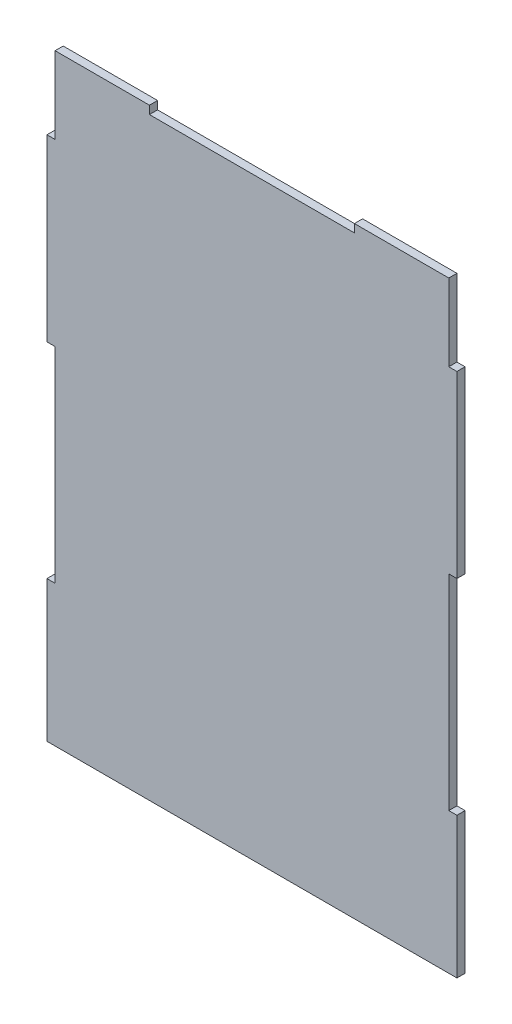
ISO-10303-21;
HEADER;
FILE_DESCRIPTION(('STEP AP214'),'2;1');
FILE_NAME('part.step','',(''),(''),'','','');
FILE_SCHEMA(('AUTOMOTIVE_DESIGN { 1 0 10303 214 1 1 1 1 }'));
ENDSEC;
DATA;
#1=APPLICATION_CONTEXT('core data for automotive mechanical design processes');
#2=APPLICATION_PROTOCOL_DEFINITION('international standard','automotive_design',2000,#1);
#3=PRODUCT_CONTEXT('',#1,'mechanical');
#4=PRODUCT('Part','Part','',(#3));
#5=PRODUCT_RELATED_PRODUCT_CATEGORY('part','',(#4));
#6=PRODUCT_DEFINITION_FORMATION('','',#4);
#7=PRODUCT_DEFINITION_CONTEXT('part definition',#1,'design');
#8=PRODUCT_DEFINITION('design','',#6,#7);
#9=PRODUCT_DEFINITION_SHAPE('','',#8);
#10=(LENGTH_UNIT() NAMED_UNIT(*) SI_UNIT(.MILLI.,.METRE.));
#11=(NAMED_UNIT(*) PLANE_ANGLE_UNIT() SI_UNIT($,.RADIAN.));
#12=(NAMED_UNIT(*) SI_UNIT($,.STERADIAN.) SOLID_ANGLE_UNIT());
#13=UNCERTAINTY_MEASURE_WITH_UNIT(LENGTH_MEASURE(1.E-05),#10,'distance_accuracy_value','');
#14=(GEOMETRIC_REPRESENTATION_CONTEXT(3) GLOBAL_UNCERTAINTY_ASSIGNED_CONTEXT((#13)) GLOBAL_UNIT_ASSIGNED_CONTEXT((#10,
#11,#12)) REPRESENTATION_CONTEXT('',''));
#15=CARTESIAN_POINT('',(0.,0.,0.));
#16=DIRECTION('',(0.,0.,1.));
#17=DIRECTION('',(1.,0.,0.));
#18=AXIS2_PLACEMENT_3D('',#15,#16,#17);
#19=CARTESIAN_POINT('',(-80.,0.,-3.175));
#20=DIRECTION('',(-1.,0.,0.));
#21=DIRECTION('',(0.,0.,1.));
#22=AXIS2_PLACEMENT_3D('',#19,#20,#21);
#23=PLANE('',#22);
#24=DIRECTION('',(0.,-1.,0.));
#25=VECTOR('',#24,1.);
#26=CARTESIAN_POINT('',(-80.,0.,0.));
#27=LINE('',#26,#25);
#28=CARTESIAN_POINT('',(-80.,55.,0.));
#29=VERTEX_POINT('',#28);
#30=CARTESIAN_POINT('',(-80.,0.,0.));
#31=VERTEX_POINT('',#30);
#32=EDGE_CURVE('E251',#29,#31,#27,.T.);
#33=ORIENTED_EDGE('',*,*,#32,.F.);
#34=DIRECTION('',(0.,0.,1.));
#35=VECTOR('',#34,1.);
#36=CARTESIAN_POINT('',(-80.,55.,-3.175));
#37=LINE('',#36,#35);
#38=CARTESIAN_POINT('',(-80.,55.,-3.175));
#39=VERTEX_POINT('',#38);
#40=EDGE_CURVE('E42',#39,#29,#37,.T.);
#41=ORIENTED_EDGE('',*,*,#40,.F.);
#42=DIRECTION('',(0.,-1.,0.));
#43=VECTOR('',#42,1.);
#44=CARTESIAN_POINT('',(-80.,0.,-3.175));
#45=LINE('',#44,#43);
#46=CARTESIAN_POINT('',(-80.,0.,-3.175));
#47=VERTEX_POINT('',#46);
#48=EDGE_CURVE('E189',#39,#47,#45,.T.);
#49=ORIENTED_EDGE('',*,*,#48,.T.);
#50=DIRECTION('',(0.,0.,1.));
#51=VECTOR('',#50,1.);
#52=CARTESIAN_POINT('',(-80.,0.,-3.175));
#53=LINE('',#52,#51);
#54=EDGE_CURVE('E11',#47,#31,#53,.T.);
#55=ORIENTED_EDGE('',*,*,#54,.T.);
#56=EDGE_LOOP('',(#33,#41,#49,#55));
#57=FACE_BOUND('',#56,.T.);
#58=ADVANCED_FACE('F32',(#57),#23,.T.);
#59=CARTESIAN_POINT('',(-80.,55.,-3.175));
#60=DIRECTION('',(0.,1.,0.));
#61=DIRECTION('',(0.,0.,1.));
#62=AXIS2_PLACEMENT_3D('',#59,#60,#61);
#63=PLANE('',#62);
#64=DIRECTION('',(-1.,0.,0.));
#65=VECTOR('',#64,1.);
#66=CARTESIAN_POINT('',(-80.,55.,0.));
#67=LINE('',#66,#65);
#68=CARTESIAN_POINT('',(-76.825,55.,0.));
#69=VERTEX_POINT('',#68);
#70=EDGE_CURVE('E175',#69,#29,#67,.T.);
#71=ORIENTED_EDGE('',*,*,#70,.F.);
#72=DIRECTION('',(0.,0.,1.));
#73=VECTOR('',#72,1.);
#74=CARTESIAN_POINT('',(-76.825,55.,-3.175));
#75=LINE('',#74,#73);
#76=CARTESIAN_POINT('',(-76.825,55.,-3.175));
#77=VERTEX_POINT('',#76);
#78=EDGE_CURVE('E170',#77,#69,#75,.T.);
#79=ORIENTED_EDGE('',*,*,#78,.F.);
#80=DIRECTION('',(-1.,0.,0.));
#81=VECTOR('',#80,1.);
#82=CARTESIAN_POINT('',(-80.,55.,-3.175));
#83=LINE('',#82,#81);
#84=EDGE_CURVE('E173',#77,#39,#83,.T.);
#85=ORIENTED_EDGE('',*,*,#84,.T.);
#86=ORIENTED_EDGE('',*,*,#40,.T.);
#87=EDGE_LOOP('',(#71,#79,#85,#86));
#88=FACE_BOUND('',#87,.T.);
#89=ADVANCED_FACE('F172',(#88),#63,.T.);
#90=CARTESIAN_POINT('',(-76.825,55.,-3.175));
#91=DIRECTION('',(-1.,0.,0.));
#92=DIRECTION('',(0.,0.,1.));
#93=AXIS2_PLACEMENT_3D('',#90,#91,#92);
#94=PLANE('',#93);
#95=DIRECTION('',(0.,-1.,0.));
#96=VECTOR('',#95,1.);
#97=CARTESIAN_POINT('',(-76.825,55.,0.));
#98=LINE('',#97,#96);
#99=CARTESIAN_POINT('',(-76.825,135.,0.));
#100=VERTEX_POINT('',#99);
#101=EDGE_CURVE('E248',#100,#69,#98,.T.);
#102=ORIENTED_EDGE('',*,*,#101,.F.);
#103=DIRECTION('',(0.,0.,1.));
#104=VECTOR('',#103,1.);
#105=CARTESIAN_POINT('',(-76.825,135.,-3.175));
#106=LINE('',#105,#104);
#107=CARTESIAN_POINT('',(-76.825,135.,-3.175));
#108=VERTEX_POINT('',#107);
#109=EDGE_CURVE('E180',#108,#100,#106,.T.);
#110=ORIENTED_EDGE('',*,*,#109,.F.);
#111=DIRECTION('',(0.,-1.,0.));
#112=VECTOR('',#111,1.);
#113=CARTESIAN_POINT('',(-76.825,55.,-3.175));
#114=LINE('',#113,#112);
#115=EDGE_CURVE('E186',#108,#77,#114,.T.);
#116=ORIENTED_EDGE('',*,*,#115,.T.);
#117=ORIENTED_EDGE('',*,*,#78,.T.);
#118=EDGE_LOOP('',(#102,#110,#116,#117));
#119=FACE_BOUND('',#118,.T.);
#120=ADVANCED_FACE('F191',(#119),#94,.T.);
#121=CARTESIAN_POINT('',(-76.825,135.,-3.175));
#122=DIRECTION('',(0.,-1.,0.));
#123=DIRECTION('',(0.,0.,-1.));
#124=AXIS2_PLACEMENT_3D('',#121,#122,#123);
#125=PLANE('',#124);
#126=DIRECTION('',(1.,0.,0.));
#127=VECTOR('',#126,1.);
#128=CARTESIAN_POINT('',(-76.825,135.,0.));
#129=LINE('',#128,#127);
#130=CARTESIAN_POINT('',(-80.,135.,0.));
#131=VERTEX_POINT('',#130);
#132=EDGE_CURVE('E245',#131,#100,#129,.T.);
#133=ORIENTED_EDGE('',*,*,#132,.F.);
#134=DIRECTION('',(0.,0.,1.));
#135=VECTOR('',#134,1.);
#136=CARTESIAN_POINT('',(-80.,135.,-3.175));
#137=LINE('',#136,#135);
#138=CARTESIAN_POINT('',(-80.,135.,-3.175));
#139=VERTEX_POINT('',#138);
#140=EDGE_CURVE('E256',#139,#131,#137,.T.);
#141=ORIENTED_EDGE('',*,*,#140,.F.);
#142=DIRECTION('',(1.,0.,0.));
#143=VECTOR('',#142,1.);
#144=CARTESIAN_POINT('',(-76.825,135.,-3.175));
#145=LINE('',#144,#143);
#146=EDGE_CURVE('E192',#139,#108,#145,.T.);
#147=ORIENTED_EDGE('',*,*,#146,.T.);
#148=ORIENTED_EDGE('',*,*,#109,.T.);
#149=EDGE_LOOP('',(#133,#141,#147,#148));
#150=FACE_BOUND('',#149,.T.);
#151=ADVANCED_FACE('F306',(#150),#125,.T.);
#152=CARTESIAN_POINT('',(-80.,135.,-3.175));
#153=DIRECTION('',(-1.,0.,0.));
#154=DIRECTION('',(0.,0.,1.));
#155=AXIS2_PLACEMENT_3D('',#152,#153,#154);
#156=PLANE('',#155);
#157=DIRECTION('',(0.,-1.,0.));
#158=VECTOR('',#157,1.);
#159=CARTESIAN_POINT('',(-80.,135.,0.));
#160=LINE('',#159,#158);
#161=CARTESIAN_POINT('',(-80.,205.,0.));
#162=VERTEX_POINT('',#161);
#163=EDGE_CURVE('E242',#162,#131,#160,.T.);
#164=ORIENTED_EDGE('',*,*,#163,.F.);
#165=DIRECTION('',(0.,0.,1.));
#166=VECTOR('',#165,1.);
#167=CARTESIAN_POINT('',(-80.,205.,-3.175));
#168=LINE('',#167,#166);
#169=CARTESIAN_POINT('',(-80.,205.,-3.175));
#170=VERTEX_POINT('',#169);
#171=EDGE_CURVE('E258',#170,#162,#168,.T.);
#172=ORIENTED_EDGE('',*,*,#171,.F.);
#173=DIRECTION('',(0.,-1.,0.));
#174=VECTOR('',#173,1.);
#175=CARTESIAN_POINT('',(-80.,135.,-3.175));
#176=LINE('',#175,#174);
#177=EDGE_CURVE('E194',#170,#139,#176,.T.);
#178=ORIENTED_EDGE('',*,*,#177,.T.);
#179=ORIENTED_EDGE('',*,*,#140,.T.);
#180=EDGE_LOOP('',(#164,#172,#178,#179));
#181=FACE_BOUND('',#180,.T.);
#182=ADVANCED_FACE('F309',(#181),#156,.T.);
#183=CARTESIAN_POINT('',(-80.,205.,-3.175));
#184=DIRECTION('',(0.,1.,0.));
#185=DIRECTION('',(0.,0.,1.));
#186=AXIS2_PLACEMENT_3D('',#183,#184,#185);
#187=PLANE('',#186);
#188=DIRECTION('',(-1.,0.,0.));
#189=VECTOR('',#188,1.);
#190=CARTESIAN_POINT('',(-80.,205.,0.));
#191=LINE('',#190,#189);
#192=CARTESIAN_POINT('',(-76.825,205.,0.));
#193=VERTEX_POINT('',#192);
#194=EDGE_CURVE('E239',#193,#162,#191,.T.);
#195=ORIENTED_EDGE('',*,*,#194,.F.);
#196=DIRECTION('',(0.,0.,1.));
#197=VECTOR('',#196,1.);
#198=CARTESIAN_POINT('',(-76.825,205.,-3.175));
#199=LINE('',#198,#197);
#200=CARTESIAN_POINT('',(-76.825,205.,-3.175));
#201=VERTEX_POINT('',#200);
#202=EDGE_CURVE('E260',#201,#193,#199,.T.);
#203=ORIENTED_EDGE('',*,*,#202,.F.);
#204=DIRECTION('',(-1.,0.,0.));
#205=VECTOR('',#204,1.);
#206=CARTESIAN_POINT('',(-80.,205.,-3.175));
#207=LINE('',#206,#205);
#208=EDGE_CURVE('E552',#201,#170,#207,.T.);
#209=ORIENTED_EDGE('',*,*,#208,.T.);
#210=ORIENTED_EDGE('',*,*,#171,.T.);
#211=EDGE_LOOP('',(#195,#203,#209,#210));
#212=FACE_BOUND('',#211,.T.);
#213=ADVANCED_FACE('F313',(#212),#187,.T.);
#214=CARTESIAN_POINT('',(-76.825,205.,-3.175));
#215=DIRECTION('',(-1.,0.,0.));
#216=DIRECTION('',(0.,0.,1.));
#217=AXIS2_PLACEMENT_3D('',#214,#215,#216);
#218=PLANE('',#217);
#219=DIRECTION('',(0.,-1.,0.));
#220=VECTOR('',#219,1.);
#221=CARTESIAN_POINT('',(-76.825,205.,0.));
#222=LINE('',#221,#220);
#223=CARTESIAN_POINT('',(-76.825,235.,0.));
#224=VERTEX_POINT('',#223);
#225=EDGE_CURVE('E236',#224,#193,#222,.T.);
#226=ORIENTED_EDGE('',*,*,#225,.F.);
#227=DIRECTION('',(0.,0.,1.));
#228=VECTOR('',#227,1.);
#229=CARTESIAN_POINT('',(-76.825,235.,-3.175));
#230=LINE('',#229,#228);
#231=CARTESIAN_POINT('',(-76.825,235.,-3.175));
#232=VERTEX_POINT('',#231);
#233=EDGE_CURVE('E262',#232,#224,#230,.T.);
#234=ORIENTED_EDGE('',*,*,#233,.F.);
#235=DIRECTION('',(0.,-1.,0.));
#236=VECTOR('',#235,1.);
#237=CARTESIAN_POINT('',(-76.825,205.,-3.175));
#238=LINE('',#237,#236);
#239=EDGE_CURVE('E549',#232,#201,#238,.T.);
#240=ORIENTED_EDGE('',*,*,#239,.T.);
#241=ORIENTED_EDGE('',*,*,#202,.T.);
#242=EDGE_LOOP('',(#226,#234,#240,#241));
#243=FACE_BOUND('',#242,.T.);
#244=ADVANCED_FACE('F317',(#243),#218,.T.);
#245=CARTESIAN_POINT('',(-76.825,235.,-3.175));
#246=DIRECTION('',(0.,1.,0.));
#247=DIRECTION('',(0.,0.,1.));
#248=AXIS2_PLACEMENT_3D('',#245,#246,#247);
#249=PLANE('',#248);
#250=DIRECTION('',(-1.,0.,0.));
#251=VECTOR('',#250,1.);
#252=CARTESIAN_POINT('',(-76.825,235.,0.));
#253=LINE('',#252,#251);
#254=CARTESIAN_POINT('',(-40.,235.,0.));
#255=VERTEX_POINT('',#254);
#256=EDGE_CURVE('E233',#255,#224,#253,.T.);
#257=ORIENTED_EDGE('',*,*,#256,.F.);
#258=DIRECTION('',(0.,0.,1.));
#259=VECTOR('',#258,1.);
#260=CARTESIAN_POINT('',(-40.,235.,-3.175));
#261=LINE('',#260,#259);
#262=CARTESIAN_POINT('',(-40.,235.,-3.175));
#263=VERTEX_POINT('',#262);
#264=EDGE_CURVE('E264',#263,#255,#261,.T.);
#265=ORIENTED_EDGE('',*,*,#264,.F.);
#266=DIRECTION('',(-1.,0.,0.));
#267=VECTOR('',#266,1.);
#268=CARTESIAN_POINT('',(-76.825,235.,-3.175));
#269=LINE('',#268,#267);
#270=EDGE_CURVE('E541',#263,#232,#269,.T.);
#271=ORIENTED_EDGE('',*,*,#270,.T.);
#272=ORIENTED_EDGE('',*,*,#233,.T.);
#273=EDGE_LOOP('',(#257,#265,#271,#272));
#274=FACE_BOUND('',#273,.T.);
#275=ADVANCED_FACE('F321',(#274),#249,.T.);
#276=CARTESIAN_POINT('',(-40.,235.,-3.175));
#277=DIRECTION('',(1.,0.,0.));
#278=DIRECTION('',(0.,0.,-1.));
#279=AXIS2_PLACEMENT_3D('',#276,#277,#278);
#280=PLANE('',#279);
#281=DIRECTION('',(0.,1.,0.));
#282=VECTOR('',#281,1.);
#283=CARTESIAN_POINT('',(-40.,235.,0.));
#284=LINE('',#283,#282);
#285=CARTESIAN_POINT('',(-40.,231.825,0.));
#286=VERTEX_POINT('',#285);
#287=EDGE_CURVE('E230',#286,#255,#284,.T.);
#288=ORIENTED_EDGE('',*,*,#287,.F.);
#289=DIRECTION('',(0.,0.,1.));
#290=VECTOR('',#289,1.);
#291=CARTESIAN_POINT('',(-40.,231.825,-3.175));
#292=LINE('',#291,#290);
#293=CARTESIAN_POINT('',(-40.,231.825,-3.175));
#294=VERTEX_POINT('',#293);
#295=EDGE_CURVE('E266',#294,#286,#292,.T.);
#296=ORIENTED_EDGE('',*,*,#295,.F.);
#297=DIRECTION('',(0.,1.,0.));
#298=VECTOR('',#297,1.);
#299=CARTESIAN_POINT('',(-40.,235.,-3.175));
#300=LINE('',#299,#298);
#301=EDGE_CURVE('E539',#294,#263,#300,.T.);
#302=ORIENTED_EDGE('',*,*,#301,.T.);
#303=ORIENTED_EDGE('',*,*,#264,.T.);
#304=EDGE_LOOP('',(#288,#296,#302,#303));
#305=FACE_BOUND('',#304,.T.);
#306=ADVANCED_FACE('F325',(#305),#280,.T.);
#307=CARTESIAN_POINT('',(-40.,231.825,-3.175));
#308=DIRECTION('',(0.,1.,0.));
#309=DIRECTION('',(0.,0.,1.));
#310=AXIS2_PLACEMENT_3D('',#307,#308,#309);
#311=PLANE('',#310);
#312=DIRECTION('',(-1.,0.,0.));
#313=VECTOR('',#312,1.);
#314=CARTESIAN_POINT('',(-40.,231.825,0.));
#315=LINE('',#314,#313);
#316=CARTESIAN_POINT('',(40.,231.825,0.));
#317=VERTEX_POINT('',#316);
#318=EDGE_CURVE('E227',#317,#286,#315,.T.);
#319=ORIENTED_EDGE('',*,*,#318,.F.);
#320=DIRECTION('',(0.,0.,1.));
#321=VECTOR('',#320,1.);
#322=CARTESIAN_POINT('',(40.,231.825,-3.175));
#323=LINE('',#322,#321);
#324=CARTESIAN_POINT('',(40.,231.825,-3.175));
#325=VERTEX_POINT('',#324);
#326=EDGE_CURVE('E268',#325,#317,#323,.T.);
#327=ORIENTED_EDGE('',*,*,#326,.F.);
#328=DIRECTION('',(-1.,0.,0.));
#329=VECTOR('',#328,1.);
#330=CARTESIAN_POINT('',(40.,231.825,-3.175));
#331=LINE('',#330,#329);
#332=EDGE_CURVE('E534',#325,#294,#331,.T.);
#333=ORIENTED_EDGE('',*,*,#332,.T.);
#334=ORIENTED_EDGE('',*,*,#295,.T.);
#335=EDGE_LOOP('',(#319,#327,#333,#334));
#336=FACE_BOUND('',#335,.T.);
#337=ADVANCED_FACE('F329',(#336),#311,.T.);
#338=CARTESIAN_POINT('',(40.,235.,-3.175));
#339=DIRECTION('',(-1.,0.,0.));
#340=DIRECTION('',(0.,0.,1.));
#341=AXIS2_PLACEMENT_3D('',#338,#339,#340);
#342=PLANE('',#341);
#343=DIRECTION('',(0.,-1.,0.));
#344=VECTOR('',#343,1.);
#345=CARTESIAN_POINT('',(40.,235.,0.));
#346=LINE('',#345,#344);
#347=CARTESIAN_POINT('',(40.,235.,0.));
#348=VERTEX_POINT('',#347);
#349=EDGE_CURVE('E224',#348,#317,#346,.T.);
#350=ORIENTED_EDGE('',*,*,#349,.F.);
#351=DIRECTION('',(0.,0.,1.));
#352=VECTOR('',#351,1.);
#353=CARTESIAN_POINT('',(40.,235.,-3.175));
#354=LINE('',#353,#352);
#355=CARTESIAN_POINT('',(40.,235.,-3.175));
#356=VERTEX_POINT('',#355);
#357=EDGE_CURVE('E271',#356,#348,#354,.T.);
#358=ORIENTED_EDGE('',*,*,#357,.F.);
#359=DIRECTION('',(0.,-1.,0.));
#360=VECTOR('',#359,1.);
#361=CARTESIAN_POINT('',(40.,235.,-3.175));
#362=LINE('',#361,#360);
#363=EDGE_CURVE('E532',#356,#325,#362,.T.);
#364=ORIENTED_EDGE('',*,*,#363,.T.);
#365=ORIENTED_EDGE('',*,*,#326,.T.);
#366=EDGE_LOOP('',(#350,#358,#364,#365));
#367=FACE_BOUND('',#366,.T.);
#368=ADVANCED_FACE('F333',(#367),#342,.T.);
#369=CARTESIAN_POINT('',(76.825,235.,-3.175));
#370=DIRECTION('',(0.,1.,0.));
#371=DIRECTION('',(0.,0.,1.));
#372=AXIS2_PLACEMENT_3D('',#369,#370,#371);
#373=PLANE('',#372);
#374=DIRECTION('',(-1.,0.,0.));
#375=VECTOR('',#374,1.);
#376=CARTESIAN_POINT('',(76.825,235.,0.));
#377=LINE('',#376,#375);
#378=CARTESIAN_POINT('',(76.825,235.,0.));
#379=VERTEX_POINT('',#378);
#380=EDGE_CURVE('E221',#379,#348,#377,.T.);
#381=ORIENTED_EDGE('',*,*,#380,.F.);
#382=DIRECTION('',(0.,0.,1.));
#383=VECTOR('',#382,1.);
#384=CARTESIAN_POINT('',(76.825,235.,-3.175));
#385=LINE('',#384,#383);
#386=CARTESIAN_POINT('',(76.825,235.,-3.175));
#387=VERTEX_POINT('',#386);
#388=EDGE_CURVE('E273',#387,#379,#385,.T.);
#389=ORIENTED_EDGE('',*,*,#388,.F.);
#390=DIRECTION('',(-1.,0.,0.));
#391=VECTOR('',#390,1.);
#392=CARTESIAN_POINT('',(76.825,235.,-3.175));
#393=LINE('',#392,#391);
#394=EDGE_CURVE('E543',#387,#356,#393,.T.);
#395=ORIENTED_EDGE('',*,*,#394,.T.);
#396=ORIENTED_EDGE('',*,*,#357,.T.);
#397=EDGE_LOOP('',(#381,#389,#395,#396));
#398=FACE_BOUND('',#397,.T.);
#399=ADVANCED_FACE('F337',(#398),#373,.T.);
#400=CARTESIAN_POINT('',(76.825,205.,-3.175));
#401=DIRECTION('',(1.,0.,0.));
#402=DIRECTION('',(0.,0.,-1.));
#403=AXIS2_PLACEMENT_3D('',#400,#401,#402);
#404=PLANE('',#403);
#405=DIRECTION('',(0.,1.,0.));
#406=VECTOR('',#405,1.);
#407=CARTESIAN_POINT('',(76.825,205.,0.));
#408=LINE('',#407,#406);
#409=CARTESIAN_POINT('',(76.825,205.,0.));
#410=VERTEX_POINT('',#409);
#411=EDGE_CURVE('E218',#410,#379,#408,.T.);
#412=ORIENTED_EDGE('',*,*,#411,.F.);
#413=DIRECTION('',(0.,0.,1.));
#414=VECTOR('',#413,1.);
#415=CARTESIAN_POINT('',(76.825,205.,-3.175));
#416=LINE('',#415,#414);
#417=CARTESIAN_POINT('',(76.825,205.,-3.175));
#418=VERTEX_POINT('',#417);
#419=EDGE_CURVE('E275',#418,#410,#416,.T.);
#420=ORIENTED_EDGE('',*,*,#419,.F.);
#421=DIRECTION('',(0.,1.,0.));
#422=VECTOR('',#421,1.);
#423=CARTESIAN_POINT('',(76.825,205.,-3.175));
#424=LINE('',#423,#422);
#425=EDGE_CURVE('E526',#418,#387,#424,.T.);
#426=ORIENTED_EDGE('',*,*,#425,.T.);
#427=ORIENTED_EDGE('',*,*,#388,.T.);
#428=EDGE_LOOP('',(#412,#420,#426,#427));
#429=FACE_BOUND('',#428,.T.);
#430=ADVANCED_FACE('F341',(#429),#404,.T.);
#431=CARTESIAN_POINT('',(80.,205.,-3.175));
#432=DIRECTION('',(0.,1.,0.));
#433=DIRECTION('',(0.,0.,1.));
#434=AXIS2_PLACEMENT_3D('',#431,#432,#433);
#435=PLANE('',#434);
#436=DIRECTION('',(-1.,0.,0.));
#437=VECTOR('',#436,1.);
#438=CARTESIAN_POINT('',(80.,205.,0.));
#439=LINE('',#438,#437);
#440=CARTESIAN_POINT('',(80.,205.,0.));
#441=VERTEX_POINT('',#440);
#442=EDGE_CURVE('E215',#441,#410,#439,.T.);
#443=ORIENTED_EDGE('',*,*,#442,.F.);
#444=DIRECTION('',(0.,0.,1.));
#445=VECTOR('',#444,1.);
#446=CARTESIAN_POINT('',(80.,205.,-3.175));
#447=LINE('',#446,#445);
#448=CARTESIAN_POINT('',(80.,205.,-3.175));
#449=VERTEX_POINT('',#448);
#450=EDGE_CURVE('E277',#449,#441,#447,.T.);
#451=ORIENTED_EDGE('',*,*,#450,.F.);
#452=DIRECTION('',(-1.,0.,0.));
#453=VECTOR('',#452,1.);
#454=CARTESIAN_POINT('',(80.,205.,-3.175));
#455=LINE('',#454,#453);
#456=EDGE_CURVE('E522',#449,#418,#455,.T.);
#457=ORIENTED_EDGE('',*,*,#456,.T.);
#458=ORIENTED_EDGE('',*,*,#419,.T.);
#459=EDGE_LOOP('',(#443,#451,#457,#458));
#460=FACE_BOUND('',#459,.T.);
#461=ADVANCED_FACE('F345',(#460),#435,.T.);
#462=CARTESIAN_POINT('',(80.,135.,-3.175));
#463=DIRECTION('',(1.,0.,0.));
#464=DIRECTION('',(0.,0.,-1.));
#465=AXIS2_PLACEMENT_3D('',#462,#463,#464);
#466=PLANE('',#465);
#467=DIRECTION('',(0.,1.,0.));
#468=VECTOR('',#467,1.);
#469=CARTESIAN_POINT('',(80.,135.,0.));
#470=LINE('',#469,#468);
#471=CARTESIAN_POINT('',(80.,135.,0.));
#472=VERTEX_POINT('',#471);
#473=EDGE_CURVE('E212',#472,#441,#470,.T.);
#474=ORIENTED_EDGE('',*,*,#473,.F.);
#475=DIRECTION('',(0.,0.,1.));
#476=VECTOR('',#475,1.);
#477=CARTESIAN_POINT('',(80.,135.,-3.175));
#478=LINE('',#477,#476);
#479=CARTESIAN_POINT('',(80.,135.,-3.175));
#480=VERTEX_POINT('',#479);
#481=EDGE_CURVE('E279',#480,#472,#478,.T.);
#482=ORIENTED_EDGE('',*,*,#481,.F.);
#483=DIRECTION('',(0.,1.,0.));
#484=VECTOR('',#483,1.);
#485=CARTESIAN_POINT('',(80.,135.,-3.175));
#486=LINE('',#485,#484);
#487=EDGE_CURVE('E567',#480,#449,#486,.T.);
#488=ORIENTED_EDGE('',*,*,#487,.T.);
#489=ORIENTED_EDGE('',*,*,#450,.T.);
#490=EDGE_LOOP('',(#474,#482,#488,#489));
#491=FACE_BOUND('',#490,.T.);
#492=ADVANCED_FACE('F349',(#491),#466,.T.);
#493=CARTESIAN_POINT('',(76.825,135.,-3.175));
#494=DIRECTION('',(0.,-1.,0.));
#495=DIRECTION('',(0.,0.,-1.));
#496=AXIS2_PLACEMENT_3D('',#493,#494,#495);
#497=PLANE('',#496);
#498=DIRECTION('',(1.,0.,0.));
#499=VECTOR('',#498,1.);
#500=CARTESIAN_POINT('',(76.825,135.,0.));
#501=LINE('',#500,#499);
#502=CARTESIAN_POINT('',(76.825,135.,0.));
#503=VERTEX_POINT('',#502);
#504=EDGE_CURVE('E209',#503,#472,#501,.T.);
#505=ORIENTED_EDGE('',*,*,#504,.F.);
#506=DIRECTION('',(0.,0.,1.));
#507=VECTOR('',#506,1.);
#508=CARTESIAN_POINT('',(76.825,135.,-3.175));
#509=LINE('',#508,#507);
#510=CARTESIAN_POINT('',(76.825,135.,-3.175));
#511=VERTEX_POINT('',#510);
#512=EDGE_CURVE('E281',#511,#503,#509,.T.);
#513=ORIENTED_EDGE('',*,*,#512,.F.);
#514=DIRECTION('',(1.,0.,0.));
#515=VECTOR('',#514,1.);
#516=CARTESIAN_POINT('',(76.825,135.,-3.175));
#517=LINE('',#516,#515);
#518=EDGE_CURVE('E515',#511,#480,#517,.T.);
#519=ORIENTED_EDGE('',*,*,#518,.T.);
#520=ORIENTED_EDGE('',*,*,#481,.T.);
#521=EDGE_LOOP('',(#505,#513,#519,#520));
#522=FACE_BOUND('',#521,.T.);
#523=ADVANCED_FACE('F353',(#522),#497,.T.);
#524=CARTESIAN_POINT('',(76.825,55.,-3.175));
#525=DIRECTION('',(1.,0.,0.));
#526=DIRECTION('',(0.,0.,-1.));
#527=AXIS2_PLACEMENT_3D('',#524,#525,#526);
#528=PLANE('',#527);
#529=DIRECTION('',(0.,1.,0.));
#530=VECTOR('',#529,1.);
#531=CARTESIAN_POINT('',(76.825,55.,0.));
#532=LINE('',#531,#530);
#533=CARTESIAN_POINT('',(76.825,55.,0.));
#534=VERTEX_POINT('',#533);
#535=EDGE_CURVE('E206',#534,#503,#532,.T.);
#536=ORIENTED_EDGE('',*,*,#535,.F.);
#537=DIRECTION('',(0.,0.,1.));
#538=VECTOR('',#537,1.);
#539=CARTESIAN_POINT('',(76.825,55.,-3.175));
#540=LINE('',#539,#538);
#541=CARTESIAN_POINT('',(76.825,55.,-3.175));
#542=VERTEX_POINT('',#541);
#543=EDGE_CURVE('E283',#542,#534,#540,.T.);
#544=ORIENTED_EDGE('',*,*,#543,.F.);
#545=DIRECTION('',(0.,1.,0.));
#546=VECTOR('',#545,1.);
#547=CARTESIAN_POINT('',(76.825,55.,-3.175));
#548=LINE('',#547,#546);
#549=EDGE_CURVE('E511',#542,#511,#548,.T.);
#550=ORIENTED_EDGE('',*,*,#549,.T.);
#551=ORIENTED_EDGE('',*,*,#512,.T.);
#552=EDGE_LOOP('',(#536,#544,#550,#551));
#553=FACE_BOUND('',#552,.T.);
#554=ADVANCED_FACE('F357',(#553),#528,.T.);
#555=CARTESIAN_POINT('',(80.,55.,-3.175));
#556=DIRECTION('',(0.,1.,0.));
#557=DIRECTION('',(0.,0.,1.));
#558=AXIS2_PLACEMENT_3D('',#555,#556,#557);
#559=PLANE('',#558);
#560=DIRECTION('',(-1.,0.,0.));
#561=VECTOR('',#560,1.);
#562=CARTESIAN_POINT('',(80.,55.,0.));
#563=LINE('',#562,#561);
#564=CARTESIAN_POINT('',(80.,55.,0.));
#565=VERTEX_POINT('',#564);
#566=EDGE_CURVE('E203',#565,#534,#563,.T.);
#567=ORIENTED_EDGE('',*,*,#566,.F.);
#568=DIRECTION('',(0.,0.,1.));
#569=VECTOR('',#568,1.);
#570=CARTESIAN_POINT('',(80.,55.,-3.175));
#571=LINE('',#570,#569);
#572=CARTESIAN_POINT('',(80.,55.,-3.175));
#573=VERTEX_POINT('',#572);
#574=EDGE_CURVE('E284',#573,#565,#571,.T.);
#575=ORIENTED_EDGE('',*,*,#574,.F.);
#576=DIRECTION('',(-1.,0.,0.));
#577=VECTOR('',#576,1.);
#578=CARTESIAN_POINT('',(80.,55.,-3.175));
#579=LINE('',#578,#577);
#580=EDGE_CURVE('E571',#573,#542,#579,.T.);
#581=ORIENTED_EDGE('',*,*,#580,.T.);
#582=ORIENTED_EDGE('',*,*,#543,.T.);
#583=EDGE_LOOP('',(#567,#575,#581,#582));
#584=FACE_BOUND('',#583,.T.);
#585=ADVANCED_FACE('F361',(#584),#559,.T.);
#586=CARTESIAN_POINT('',(80.,0.,-3.175));
#587=DIRECTION('',(1.,0.,0.));
#588=DIRECTION('',(0.,0.,-1.));
#589=AXIS2_PLACEMENT_3D('',#586,#587,#588);
#590=PLANE('',#589);
#591=DIRECTION('',(0.,1.,0.));
#592=VECTOR('',#591,1.);
#593=CARTESIAN_POINT('',(80.,0.,0.));
#594=LINE('',#593,#592);
#595=CARTESIAN_POINT('',(80.,0.,0.));
#596=VERTEX_POINT('',#595);
#597=EDGE_CURVE('E200',#596,#565,#594,.T.);
#598=ORIENTED_EDGE('',*,*,#597,.F.);
#599=DIRECTION('',(0.,0.,1.));
#600=VECTOR('',#599,1.);
#601=CARTESIAN_POINT('',(80.,0.,-3.175));
#602=LINE('',#601,#600);
#603=CARTESIAN_POINT('',(80.,0.,-3.175));
#604=VERTEX_POINT('',#603);
#605=EDGE_CURVE('E36',#604,#596,#602,.T.);
#606=ORIENTED_EDGE('',*,*,#605,.F.);
#607=DIRECTION('',(0.,1.,0.));
#608=VECTOR('',#607,1.);
#609=CARTESIAN_POINT('',(80.,0.,-3.175));
#610=LINE('',#609,#608);
#611=EDGE_CURVE('E573',#604,#573,#610,.T.);
#612=ORIENTED_EDGE('',*,*,#611,.T.);
#613=ORIENTED_EDGE('',*,*,#574,.T.);
#614=EDGE_LOOP('',(#598,#606,#612,#613));
#615=FACE_BOUND('',#614,.T.);
#616=ADVANCED_FACE('F290',(#615),#590,.T.);
#617=CARTESIAN_POINT('',(0.,0.,-3.175));
#618=DIRECTION('',(0.,-1.,0.));
#619=DIRECTION('',(0.,0.,-1.));
#620=AXIS2_PLACEMENT_3D('',#617,#618,#619);
#621=PLANE('',#620);
#622=DIRECTION('',(1.,0.,0.));
#623=VECTOR('',#622,1.);
#624=CARTESIAN_POINT('',(0.,0.,0.));
#625=LINE('',#624,#623);
#626=EDGE_CURVE('E117',#31,#596,#625,.T.);
#627=ORIENTED_EDGE('',*,*,#626,.F.);
#628=ORIENTED_EDGE('',*,*,#54,.F.);
#629=DIRECTION('',(1.,0.,0.));
#630=VECTOR('',#629,1.);
#631=CARTESIAN_POINT('',(-80.,0.,-3.175));
#632=LINE('',#631,#630);
#633=EDGE_CURVE('E120',#47,#604,#632,.T.);
#634=ORIENTED_EDGE('',*,*,#633,.T.);
#635=ORIENTED_EDGE('',*,*,#605,.T.);
#636=EDGE_LOOP('',(#627,#628,#634,#635));
#637=FACE_BOUND('',#636,.T.);
#638=ADVANCED_FACE('F34',(#637),#621,.T.);
#639=CARTESIAN_POINT('',(0.,0.,-3.175));
#640=DIRECTION('',(0.,0.,1.));
#641=DIRECTION('',(1.,0.,0.));
#642=AXIS2_PLACEMENT_3D('',#639,#640,#641);
#643=PLANE('',#642);
#644=ORIENTED_EDGE('',*,*,#633,.F.);
#645=ORIENTED_EDGE('',*,*,#48,.F.);
#646=ORIENTED_EDGE('',*,*,#84,.F.);
#647=ORIENTED_EDGE('',*,*,#115,.F.);
#648=ORIENTED_EDGE('',*,*,#146,.F.);
#649=ORIENTED_EDGE('',*,*,#177,.F.);
#650=ORIENTED_EDGE('',*,*,#208,.F.);
#651=ORIENTED_EDGE('',*,*,#239,.F.);
#652=ORIENTED_EDGE('',*,*,#270,.F.);
#653=ORIENTED_EDGE('',*,*,#301,.F.);
#654=ORIENTED_EDGE('',*,*,#332,.F.);
#655=ORIENTED_EDGE('',*,*,#363,.F.);
#656=ORIENTED_EDGE('',*,*,#394,.F.);
#657=ORIENTED_EDGE('',*,*,#425,.F.);
#658=ORIENTED_EDGE('',*,*,#456,.F.);
#659=ORIENTED_EDGE('',*,*,#487,.F.);
#660=ORIENTED_EDGE('',*,*,#518,.F.);
#661=ORIENTED_EDGE('',*,*,#549,.F.);
#662=ORIENTED_EDGE('',*,*,#580,.F.);
#663=ORIENTED_EDGE('',*,*,#611,.F.);
#664=EDGE_LOOP('',(#644,#645,#646,#647,#648,#649,#650,#651,#652,#653,#654,#655,#656,#657,#658,
#659,#660,#661,#662,#663));
#665=FACE_BOUND('',#664,.T.);
#666=ADVANCED_FACE('F184',(#665),#643,.F.);
#667=CARTESIAN_POINT('',(0.,0.,0.));
#668=DIRECTION('',(0.,0.,1.));
#669=DIRECTION('',(1.,0.,0.));
#670=AXIS2_PLACEMENT_3D('',#667,#668,#669);
#671=PLANE('',#670);
#672=ORIENTED_EDGE('',*,*,#32,.T.);
#673=ORIENTED_EDGE('',*,*,#626,.T.);
#674=ORIENTED_EDGE('',*,*,#597,.T.);
#675=ORIENTED_EDGE('',*,*,#566,.T.);
#676=ORIENTED_EDGE('',*,*,#535,.T.);
#677=ORIENTED_EDGE('',*,*,#504,.T.);
#678=ORIENTED_EDGE('',*,*,#473,.T.);
#679=ORIENTED_EDGE('',*,*,#442,.T.);
#680=ORIENTED_EDGE('',*,*,#411,.T.);
#681=ORIENTED_EDGE('',*,*,#380,.T.);
#682=ORIENTED_EDGE('',*,*,#349,.T.);
#683=ORIENTED_EDGE('',*,*,#318,.T.);
#684=ORIENTED_EDGE('',*,*,#287,.T.);
#685=ORIENTED_EDGE('',*,*,#256,.T.);
#686=ORIENTED_EDGE('',*,*,#225,.T.);
#687=ORIENTED_EDGE('',*,*,#194,.T.);
#688=ORIENTED_EDGE('',*,*,#163,.T.);
#689=ORIENTED_EDGE('',*,*,#132,.T.);
#690=ORIENTED_EDGE('',*,*,#101,.T.);
#691=ORIENTED_EDGE('',*,*,#70,.T.);
#692=EDGE_LOOP('',(#672,#673,#674,#675,#676,#677,#678,#679,#680,#681,#682,#683,#684,#685,#686,
#687,#688,#689,#690,#691));
#693=FACE_BOUND('',#692,.T.);
#694=ADVANCED_FACE('F292',(#693),#671,.T.);
#695=CLOSED_SHELL('',(#58,#89,#120,#151,#182,#213,#244,#275,#306,#337,#368,#399,#430,#461,#492,
#523,#554,#585,#616,#638,#666,#694));
#696=MANIFOLD_SOLID_BREP('B2',#695);
#697=ADVANCED_BREP_SHAPE_REPRESENTATION('',(#18,#696),#14);
#698=SHAPE_DEFINITION_REPRESENTATION(#9,#697);
ENDSEC;
END-ISO-10303-21;
